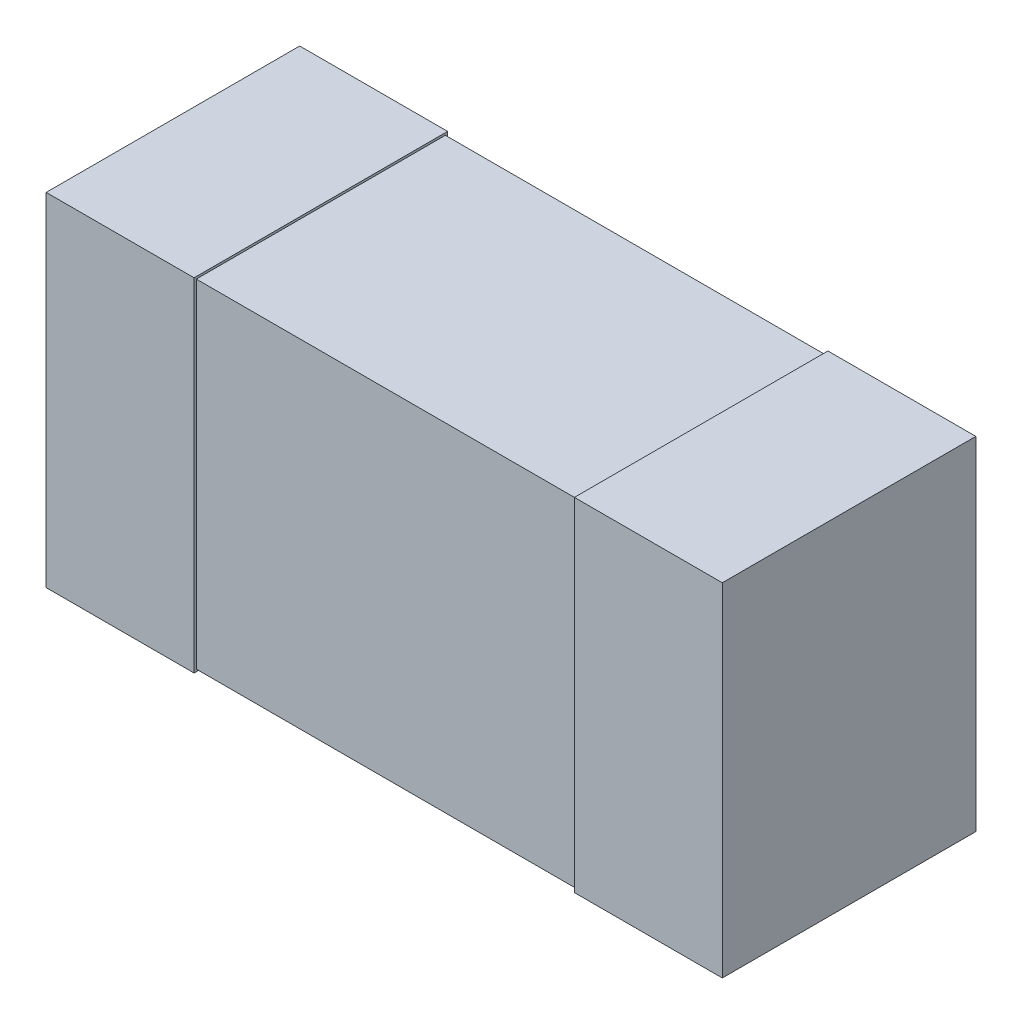
ISO-10303-21;
HEADER;
FILE_DESCRIPTION(('STEP AP214'),'2;1');
FILE_NAME('part.step','',(''),(''),'','','');
FILE_SCHEMA(('AUTOMOTIVE_DESIGN { 1 0 10303 214 1 1 1 1 }'));
ENDSEC;
DATA;
#1=APPLICATION_CONTEXT('core data for automotive mechanical design processes');
#2=APPLICATION_PROTOCOL_DEFINITION('international standard','automotive_design',2000,#1);
#3=PRODUCT_CONTEXT('',#1,'mechanical');
#4=PRODUCT('Part','Part','',(#3));
#5=PRODUCT_RELATED_PRODUCT_CATEGORY('part','',(#4));
#6=PRODUCT_DEFINITION_FORMATION('','',#4);
#7=PRODUCT_DEFINITION_CONTEXT('part definition',#1,'design');
#8=PRODUCT_DEFINITION('design','',#6,#7);
#9=PRODUCT_DEFINITION_SHAPE('','',#8);
#10=(LENGTH_UNIT() NAMED_UNIT(*) SI_UNIT(.MILLI.,.METRE.));
#11=(NAMED_UNIT(*) PLANE_ANGLE_UNIT() SI_UNIT($,.RADIAN.));
#12=(NAMED_UNIT(*) SI_UNIT($,.STERADIAN.) SOLID_ANGLE_UNIT());
#13=UNCERTAINTY_MEASURE_WITH_UNIT(LENGTH_MEASURE(1.E-05),#10,'distance_accuracy_value','');
#14=(GEOMETRIC_REPRESENTATION_CONTEXT(3) GLOBAL_UNCERTAINTY_ASSIGNED_CONTEXT((#13)) GLOBAL_UNIT_ASSIGNED_CONTEXT((#10,
#11,#12)) REPRESENTATION_CONTEXT('',''));
#15=CARTESIAN_POINT('',(0.,0.,0.));
#16=DIRECTION('',(0.,0.,1.));
#17=DIRECTION('',(1.,0.,0.));
#18=AXIS2_PLACEMENT_3D('',#15,#16,#17);
#19=CARTESIAN_POINT('',(0.8,-0.405,0.0762));
#20=DIRECTION('',(1.,0.,0.));
#21=DIRECTION('',(0.,1.,0.));
#22=AXIS2_PLACEMENT_3D('',#19,#20,#21);
#23=PLANE('',#22);
#24=DIRECTION('',(0.,0.,1.));
#25=VECTOR('',#24,1.);
#26=CARTESIAN_POINT('',(0.8,0.405,0.0762));
#27=LINE('',#26,#25);
#28=CARTESIAN_POINT('',(0.8,0.405,0.0762));
#29=VERTEX_POINT('',#28);
#30=CARTESIAN_POINT('',(0.8,0.405,0.6762));
#31=VERTEX_POINT('',#30);
#32=EDGE_CURVE('E150',#29,#31,#27,.T.);
#33=ORIENTED_EDGE('',*,*,#32,.T.);
#34=DIRECTION('',(0.,1.,0.));
#35=VECTOR('',#34,1.);
#36=CARTESIAN_POINT('',(0.8,-0.405,0.6762));
#37=LINE('',#36,#35);
#38=CARTESIAN_POINT('',(0.8,-0.405,0.6762));
#39=VERTEX_POINT('',#38);
#40=EDGE_CURVE('E138',#39,#31,#37,.T.);
#41=ORIENTED_EDGE('',*,*,#40,.F.);
#42=DIRECTION('',(0.,0.,1.));
#43=VECTOR('',#42,1.);
#44=CARTESIAN_POINT('',(0.8,-0.405,0.0762));
#45=LINE('',#44,#43);
#46=CARTESIAN_POINT('',(0.8,-0.405,0.0762));
#47=VERTEX_POINT('',#46);
#48=EDGE_CURVE('E11',#47,#39,#45,.T.);
#49=ORIENTED_EDGE('',*,*,#48,.F.);
#50=DIRECTION('',(0.,1.,0.));
#51=VECTOR('',#50,1.);
#52=CARTESIAN_POINT('',(0.8,-0.405,0.0762));
#53=LINE('',#52,#51);
#54=EDGE_CURVE('E152',#47,#29,#53,.T.);
#55=ORIENTED_EDGE('',*,*,#54,.T.);
#56=EDGE_LOOP('',(#33,#41,#49,#55));
#57=FACE_BOUND('',#56,.T.);
#58=ADVANCED_FACE('F18',(#57),#23,.T.);
#59=CARTESIAN_POINT('',(-0.8,0.405,0.0762));
#60=DIRECTION('',(-1.,0.,0.));
#61=DIRECTION('',(0.,0.,1.));
#62=AXIS2_PLACEMENT_3D('',#59,#60,#61);
#63=PLANE('',#62);
#64=DIRECTION('',(0.,0.,1.));
#65=VECTOR('',#64,1.);
#66=CARTESIAN_POINT('',(-0.8,-0.405,0.0762));
#67=LINE('',#66,#65);
#68=CARTESIAN_POINT('',(-0.8,-0.405,0.0762));
#69=VERTEX_POINT('',#68);
#70=CARTESIAN_POINT('',(-0.8,-0.405,0.6762));
#71=VERTEX_POINT('',#70);
#72=EDGE_CURVE('E28',#69,#71,#67,.T.);
#73=ORIENTED_EDGE('',*,*,#72,.T.);
#74=DIRECTION('',(0.,-1.,0.));
#75=VECTOR('',#74,1.);
#76=CARTESIAN_POINT('',(-0.8,0.405,0.6762));
#77=LINE('',#76,#75);
#78=CARTESIAN_POINT('',(-0.8,0.405,0.6762));
#79=VERTEX_POINT('',#78);
#80=EDGE_CURVE('E157',#79,#71,#77,.T.);
#81=ORIENTED_EDGE('',*,*,#80,.F.);
#82=DIRECTION('',(0.,0.,1.));
#83=VECTOR('',#82,1.);
#84=CARTESIAN_POINT('',(-0.8,0.405,0.0762));
#85=LINE('',#84,#83);
#86=CARTESIAN_POINT('',(-0.8,0.405,0.0762));
#87=VERTEX_POINT('',#86);
#88=EDGE_CURVE('E173',#87,#79,#85,.T.);
#89=ORIENTED_EDGE('',*,*,#88,.F.);
#90=DIRECTION('',(0.,-1.,0.));
#91=VECTOR('',#90,1.);
#92=CARTESIAN_POINT('',(-0.8,0.405,0.0762));
#93=LINE('',#92,#91);
#94=EDGE_CURVE('E21',#87,#69,#93,.T.);
#95=ORIENTED_EDGE('',*,*,#94,.T.);
#96=EDGE_LOOP('',(#73,#81,#89,#95));
#97=FACE_BOUND('',#96,.T.);
#98=ADVANCED_FACE('F536',(#97),#63,.T.);
#99=CARTESIAN_POINT('',(-0.8,-0.405,0.0762));
#100=DIRECTION('',(0.,-1.,0.));
#101=DIRECTION('',(0.,0.,-1.));
#102=AXIS2_PLACEMENT_3D('',#99,#100,#101);
#103=PLANE('',#102);
#104=DIRECTION('',(1.,0.,0.));
#105=VECTOR('',#104,1.);
#106=CARTESIAN_POINT('',(0.45,-0.405,0.0762));
#107=LINE('',#106,#105);
#108=CARTESIAN_POINT('',(0.45,-0.405,0.0762));
#109=VERTEX_POINT('',#108);
#110=EDGE_CURVE('E224',#109,#47,#107,.T.);
#111=ORIENTED_EDGE('',*,*,#110,.T.);
#112=ORIENTED_EDGE('',*,*,#48,.T.);
#113=DIRECTION('',(1.,0.,0.));
#114=VECTOR('',#113,1.);
#115=CARTESIAN_POINT('',(0.45,-0.405,0.6762));
#116=LINE('',#115,#114);
#117=CARTESIAN_POINT('',(0.45,-0.405,0.6762));
#118=VERTEX_POINT('',#117);
#119=EDGE_CURVE('E145',#118,#39,#116,.T.);
#120=ORIENTED_EDGE('',*,*,#119,.F.);
#121=DIRECTION('',(0.,0.,1.));
#122=VECTOR('',#121,1.);
#123=CARTESIAN_POINT('',(0.45,-0.405,0.0762));
#124=LINE('',#123,#122);
#125=EDGE_CURVE('E199',#109,#118,#124,.T.);
#126=ORIENTED_EDGE('',*,*,#125,.F.);
#127=EDGE_LOOP('',(#111,#112,#120,#126));
#128=FACE_BOUND('',#127,.T.);
#129=ADVANCED_FACE('F281',(#128),#103,.T.);
#130=CARTESIAN_POINT('',(-0.8,-0.405,0.0762));
#131=DIRECTION('',(0.,-1.,0.));
#132=DIRECTION('',(0.,0.,-1.));
#133=AXIS2_PLACEMENT_3D('',#130,#131,#132);
#134=PLANE('',#133);
#135=DIRECTION('',(1.,0.,0.));
#136=VECTOR('',#135,1.);
#137=CARTESIAN_POINT('',(-0.8,-0.405,0.6762));
#138=LINE('',#137,#136);
#139=CARTESIAN_POINT('',(-0.45,-0.405,0.6762));
#140=VERTEX_POINT('',#139);
#141=EDGE_CURVE('E238',#71,#140,#138,.T.);
#142=ORIENTED_EDGE('',*,*,#141,.F.);
#143=ORIENTED_EDGE('',*,*,#72,.F.);
#144=DIRECTION('',(1.,0.,0.));
#145=VECTOR('',#144,1.);
#146=CARTESIAN_POINT('',(-0.8,-0.405,0.0762));
#147=LINE('',#146,#145);
#148=CARTESIAN_POINT('',(-0.45,-0.405,0.0762));
#149=VERTEX_POINT('',#148);
#150=EDGE_CURVE('E226',#69,#149,#147,.T.);
#151=ORIENTED_EDGE('',*,*,#150,.T.);
#152=DIRECTION('',(0.,0.,1.));
#153=VECTOR('',#152,1.);
#154=CARTESIAN_POINT('',(-0.45,-0.405,0.0762));
#155=LINE('',#154,#153);
#156=EDGE_CURVE('E83',#149,#140,#155,.T.);
#157=ORIENTED_EDGE('',*,*,#156,.T.);
#158=EDGE_LOOP('',(#142,#143,#151,#157));
#159=FACE_BOUND('',#158,.T.);
#160=ADVANCED_FACE('F508',(#159),#134,.T.);
#161=CARTESIAN_POINT('',(0.,0.,0.6762));
#162=DIRECTION('',(0.,0.,1.));
#163=DIRECTION('',(1.,0.,0.));
#164=AXIS2_PLACEMENT_3D('',#161,#162,#163);
#165=PLANE('',#164);
#166=ORIENTED_EDGE('',*,*,#119,.T.);
#167=ORIENTED_EDGE('',*,*,#40,.T.);
#168=DIRECTION('',(-1.,0.,0.));
#169=VECTOR('',#168,1.);
#170=CARTESIAN_POINT('',(0.8,0.405,0.6762));
#171=LINE('',#170,#169);
#172=CARTESIAN_POINT('',(0.45,0.405,0.6762));
#173=VERTEX_POINT('',#172);
#174=EDGE_CURVE('E143',#31,#173,#171,.T.);
#175=ORIENTED_EDGE('',*,*,#174,.T.);
#176=DIRECTION('',(0.,1.,0.));
#177=VECTOR('',#176,1.);
#178=CARTESIAN_POINT('',(0.45,-0.405,0.6762));
#179=LINE('',#178,#177);
#180=EDGE_CURVE('E179',#118,#173,#179,.T.);
#181=ORIENTED_EDGE('',*,*,#180,.F.);
#182=EDGE_LOOP('',(#166,#167,#175,#181));
#183=FACE_BOUND('',#182,.T.);
#184=ADVANCED_FACE('F140',(#183),#165,.T.);
#185=CARTESIAN_POINT('',(0.,0.,0.6762));
#186=DIRECTION('',(0.,0.,1.));
#187=DIRECTION('',(1.,0.,0.));
#188=AXIS2_PLACEMENT_3D('',#185,#186,#187);
#189=PLANE('',#188);
#190=DIRECTION('',(-1.,0.,0.));
#191=VECTOR('',#190,1.);
#192=CARTESIAN_POINT('',(-0.45,0.405,0.6762));
#193=LINE('',#192,#191);
#194=CARTESIAN_POINT('',(-0.45,0.405,0.6762));
#195=VERTEX_POINT('',#194);
#196=EDGE_CURVE('E164',#195,#79,#193,.T.);
#197=ORIENTED_EDGE('',*,*,#196,.T.);
#198=ORIENTED_EDGE('',*,*,#80,.T.);
#199=ORIENTED_EDGE('',*,*,#141,.T.);
#200=DIRECTION('',(0.,1.,0.));
#201=VECTOR('',#200,1.);
#202=CARTESIAN_POINT('',(-0.45,-0.405,0.6762));
#203=LINE('',#202,#201);
#204=EDGE_CURVE('E184',#140,#195,#203,.T.);
#205=ORIENTED_EDGE('',*,*,#204,.T.);
#206=EDGE_LOOP('',(#197,#198,#199,#205));
#207=FACE_BOUND('',#206,.T.);
#208=ADVANCED_FACE('F523',(#207),#189,.T.);
#209=CARTESIAN_POINT('',(0.8,0.405,0.0762));
#210=DIRECTION('',(0.,1.,0.));
#211=DIRECTION('',(1.,0.,0.));
#212=AXIS2_PLACEMENT_3D('',#209,#210,#211);
#213=PLANE('',#212);
#214=ORIENTED_EDGE('',*,*,#174,.F.);
#215=ORIENTED_EDGE('',*,*,#32,.F.);
#216=DIRECTION('',(-1.,0.,0.));
#217=VECTOR('',#216,1.);
#218=CARTESIAN_POINT('',(0.8,0.405,0.0762));
#219=LINE('',#218,#217);
#220=CARTESIAN_POINT('',(0.45,0.405,0.0762));
#221=VERTEX_POINT('',#220);
#222=EDGE_CURVE('E225',#29,#221,#219,.T.);
#223=ORIENTED_EDGE('',*,*,#222,.T.);
#224=DIRECTION('',(0.,0.,1.));
#225=VECTOR('',#224,1.);
#226=CARTESIAN_POINT('',(0.45,0.405,0.0762));
#227=LINE('',#226,#225);
#228=EDGE_CURVE('E161',#221,#173,#227,.T.);
#229=ORIENTED_EDGE('',*,*,#228,.T.);
#230=EDGE_LOOP('',(#214,#215,#223,#229));
#231=FACE_BOUND('',#230,.T.);
#232=ADVANCED_FACE('F159',(#231),#213,.T.);
#233=CARTESIAN_POINT('',(0.8,0.405,0.0762));
#234=DIRECTION('',(0.,1.,0.));
#235=DIRECTION('',(1.,0.,0.));
#236=AXIS2_PLACEMENT_3D('',#233,#234,#235);
#237=PLANE('',#236);
#238=DIRECTION('',(-1.,0.,0.));
#239=VECTOR('',#238,1.);
#240=CARTESIAN_POINT('',(-0.45,0.405,0.0762));
#241=LINE('',#240,#239);
#242=CARTESIAN_POINT('',(-0.45,0.405,0.0762));
#243=VERTEX_POINT('',#242);
#244=EDGE_CURVE('E254',#243,#87,#241,.T.);
#245=ORIENTED_EDGE('',*,*,#244,.T.);
#246=ORIENTED_EDGE('',*,*,#88,.T.);
#247=ORIENTED_EDGE('',*,*,#196,.F.);
#248=DIRECTION('',(0.,0.,1.));
#249=VECTOR('',#248,1.);
#250=CARTESIAN_POINT('',(-0.45,0.405,0.0762));
#251=LINE('',#250,#249);
#252=EDGE_CURVE('E209',#243,#195,#251,.T.);
#253=ORIENTED_EDGE('',*,*,#252,.F.);
#254=EDGE_LOOP('',(#245,#246,#247,#253));
#255=FACE_BOUND('',#254,.T.);
#256=ADVANCED_FACE('F585',(#255),#237,.T.);
#257=CARTESIAN_POINT('',(0.45,-0.405,0.081534));
#258=DIRECTION('',(1.,0.,0.));
#259=DIRECTION('',(0.,1.,0.));
#260=AXIS2_PLACEMENT_3D('',#257,#258,#259);
#261=PLANE('',#260);
#262=DIRECTION('',(0.,0.,1.));
#263=VECTOR('',#262,1.);
#264=CARTESIAN_POINT('',(0.45,0.399666,0.081534));
#265=LINE('',#264,#263);
#266=CARTESIAN_POINT('',(0.45,0.399666,0.081534));
#267=VERTEX_POINT('',#266);
#268=CARTESIAN_POINT('',(0.45,0.399666,0.670866));
#269=VERTEX_POINT('',#268);
#270=EDGE_CURVE('E218',#267,#269,#265,.T.);
#271=ORIENTED_EDGE('',*,*,#270,.T.);
#272=DIRECTION('',(0.,-1.,0.));
#273=VECTOR('',#272,1.);
#274=CARTESIAN_POINT('',(0.45,0.399666,0.670866));
#275=LINE('',#274,#273);
#276=CARTESIAN_POINT('',(0.45,-0.399666,0.670866));
#277=VERTEX_POINT('',#276);
#278=EDGE_CURVE('E194',#269,#277,#275,.T.);
#279=ORIENTED_EDGE('',*,*,#278,.T.);
#280=DIRECTION('',(0.,0.,-1.));
#281=VECTOR('',#280,1.);
#282=CARTESIAN_POINT('',(0.45,-0.399666,0.670866));
#283=LINE('',#282,#281);
#284=CARTESIAN_POINT('',(0.45,-0.399666,0.081534));
#285=VERTEX_POINT('',#284);
#286=EDGE_CURVE('E195',#277,#285,#283,.T.);
#287=ORIENTED_EDGE('',*,*,#286,.T.);
#288=DIRECTION('',(0.,1.,0.));
#289=VECTOR('',#288,1.);
#290=CARTESIAN_POINT('',(0.45,-0.399666,0.081534));
#291=LINE('',#290,#289);
#292=EDGE_CURVE('E196',#285,#267,#291,.T.);
#293=ORIENTED_EDGE('',*,*,#292,.T.);
#294=EDGE_LOOP('',(#271,#279,#287,#293));
#295=FACE_BOUND('',#294,.T.);
#296=ORIENTED_EDGE('',*,*,#125,.T.);
#297=ORIENTED_EDGE('',*,*,#180,.T.);
#298=ORIENTED_EDGE('',*,*,#228,.F.);
#299=DIRECTION('',(0.,1.,0.));
#300=VECTOR('',#299,1.);
#301=CARTESIAN_POINT('',(0.45,-0.405,0.0762));
#302=LINE('',#301,#300);
#303=EDGE_CURVE('E213',#109,#221,#302,.T.);
#304=ORIENTED_EDGE('',*,*,#303,.F.);
#305=EDGE_LOOP('',(#296,#297,#298,#304));
#306=FACE_BOUND('',#305,.T.);
#307=ADVANCED_FACE('F289',(#295,#306),#261,.F.);
#308=CARTESIAN_POINT('',(-0.45,-0.405,0.081534));
#309=DIRECTION('',(0.,0.,1.));
#310=DIRECTION('',(1.,0.,0.));
#311=AXIS2_PLACEMENT_3D('',#308,#309,#310);
#312=PLANE('',#311);
#313=DIRECTION('',(0.,1.,0.));
#314=VECTOR('',#313,1.);
#315=CARTESIAN_POINT('',(-0.45,-0.399666,0.081534));
#316=LINE('',#315,#314);
#317=CARTESIAN_POINT('',(-0.45,-0.399666,0.081534));
#318=VERTEX_POINT('',#317);
#319=CARTESIAN_POINT('',(-0.45,0.399666,0.081534));
#320=VERTEX_POINT('',#319);
#321=EDGE_CURVE('E177',#318,#320,#316,.T.);
#322=ORIENTED_EDGE('',*,*,#321,.T.);
#323=DIRECTION('',(1.,0.,0.));
#324=VECTOR('',#323,1.);
#325=CARTESIAN_POINT('',(-0.45,0.399666,0.081534));
#326=LINE('',#325,#324);
#327=EDGE_CURVE('E200',#320,#267,#326,.T.);
#328=ORIENTED_EDGE('',*,*,#327,.T.);
#329=ORIENTED_EDGE('',*,*,#292,.F.);
#330=DIRECTION('',(1.,0.,0.));
#331=VECTOR('',#330,1.);
#332=CARTESIAN_POINT('',(-0.45,-0.399666,0.081534));
#333=LINE('',#332,#331);
#334=EDGE_CURVE('E188',#318,#285,#333,.T.);
#335=ORIENTED_EDGE('',*,*,#334,.F.);
#336=EDGE_LOOP('',(#322,#328,#329,#335));
#337=FACE_BOUND('',#336,.T.);
#338=ADVANCED_FACE('F584',(#337),#312,.F.);
#339=CARTESIAN_POINT('',(-0.45,0.399666,0.0762));
#340=DIRECTION('',(0.,-1.,0.));
#341=DIRECTION('',(0.,0.,-1.));
#342=AXIS2_PLACEMENT_3D('',#339,#340,#341);
#343=PLANE('',#342);
#344=DIRECTION('',(0.,0.,1.));
#345=VECTOR('',#344,1.);
#346=CARTESIAN_POINT('',(-0.45,0.399666,0.081534));
#347=LINE('',#346,#345);
#348=CARTESIAN_POINT('',(-0.45,0.399666,0.670866));
#349=VERTEX_POINT('',#348);
#350=EDGE_CURVE('E257',#320,#349,#347,.T.);
#351=ORIENTED_EDGE('',*,*,#350,.T.);
#352=DIRECTION('',(1.,0.,0.));
#353=VECTOR('',#352,1.);
#354=CARTESIAN_POINT('',(-0.45,0.399666,0.670866));
#355=LINE('',#354,#353);
#356=EDGE_CURVE('E214',#349,#269,#355,.T.);
#357=ORIENTED_EDGE('',*,*,#356,.T.);
#358=ORIENTED_EDGE('',*,*,#270,.F.);
#359=ORIENTED_EDGE('',*,*,#327,.F.);
#360=EDGE_LOOP('',(#351,#357,#358,#359));
#361=FACE_BOUND('',#360,.T.);
#362=ADVANCED_FACE('F621',(#361),#343,.F.);
#363=CARTESIAN_POINT('',(-0.45,0.405,0.670866));
#364=DIRECTION('',(0.,0.,-1.));
#365=DIRECTION('',(0.,-1.,0.));
#366=AXIS2_PLACEMENT_3D('',#363,#364,#365);
#367=PLANE('',#366);
#368=DIRECTION('',(0.,-1.,0.));
#369=VECTOR('',#368,1.);
#370=CARTESIAN_POINT('',(-0.45,0.399666,0.670866));
#371=LINE('',#370,#369);
#372=CARTESIAN_POINT('',(-0.45,-0.399666,0.670866));
#373=VERTEX_POINT('',#372);
#374=EDGE_CURVE('E183',#349,#373,#371,.T.);
#375=ORIENTED_EDGE('',*,*,#374,.T.);
#376=DIRECTION('',(1.,0.,0.));
#377=VECTOR('',#376,1.);
#378=CARTESIAN_POINT('',(-0.45,-0.399666,0.670866));
#379=LINE('',#378,#377);
#380=EDGE_CURVE('E190',#373,#277,#379,.T.);
#381=ORIENTED_EDGE('',*,*,#380,.T.);
#382=ORIENTED_EDGE('',*,*,#278,.F.);
#383=ORIENTED_EDGE('',*,*,#356,.F.);
#384=EDGE_LOOP('',(#375,#381,#382,#383));
#385=FACE_BOUND('',#384,.T.);
#386=ADVANCED_FACE('F610',(#385),#367,.F.);
#387=CARTESIAN_POINT('',(-0.45,-0.399666,0.6762));
#388=DIRECTION('',(0.,1.,0.));
#389=DIRECTION('',(1.,0.,0.));
#390=AXIS2_PLACEMENT_3D('',#387,#388,#389);
#391=PLANE('',#390);
#392=DIRECTION('',(0.,0.,-1.));
#393=VECTOR('',#392,1.);
#394=CARTESIAN_POINT('',(-0.45,-0.399666,0.670866));
#395=LINE('',#394,#393);
#396=EDGE_CURVE('E185',#373,#318,#395,.T.);
#397=ORIENTED_EDGE('',*,*,#396,.T.);
#398=ORIENTED_EDGE('',*,*,#334,.T.);
#399=ORIENTED_EDGE('',*,*,#286,.F.);
#400=ORIENTED_EDGE('',*,*,#380,.F.);
#401=EDGE_LOOP('',(#397,#398,#399,#400));
#402=FACE_BOUND('',#401,.T.);
#403=ADVANCED_FACE('F598',(#402),#391,.F.);
#404=CARTESIAN_POINT('',(-0.45,-0.405,0.0762));
#405=DIRECTION('',(-1.,0.,0.));
#406=DIRECTION('',(0.,0.,1.));
#407=AXIS2_PLACEMENT_3D('',#404,#405,#406);
#408=PLANE('',#407);
#409=ORIENTED_EDGE('',*,*,#374,.F.);
#410=ORIENTED_EDGE('',*,*,#350,.F.);
#411=ORIENTED_EDGE('',*,*,#321,.F.);
#412=ORIENTED_EDGE('',*,*,#396,.F.);
#413=EDGE_LOOP('',(#409,#410,#411,#412));
#414=FACE_BOUND('',#413,.T.);
#415=ORIENTED_EDGE('',*,*,#252,.T.);
#416=ORIENTED_EDGE('',*,*,#204,.F.);
#417=ORIENTED_EDGE('',*,*,#156,.F.);
#418=DIRECTION('',(0.,1.,0.));
#419=VECTOR('',#418,1.);
#420=CARTESIAN_POINT('',(-0.45,-0.405,0.0762));
#421=LINE('',#420,#419);
#422=EDGE_CURVE('E234',#149,#243,#421,.T.);
#423=ORIENTED_EDGE('',*,*,#422,.T.);
#424=EDGE_LOOP('',(#415,#416,#417,#423));
#425=FACE_BOUND('',#424,.T.);
#426=ADVANCED_FACE('F565',(#414,#425),#408,.F.);
#427=CARTESIAN_POINT('',(0.,0.,0.0762));
#428=DIRECTION('',(0.,0.,1.));
#429=DIRECTION('',(1.,0.,0.));
#430=AXIS2_PLACEMENT_3D('',#427,#428,#429);
#431=PLANE('',#430);
#432=ORIENTED_EDGE('',*,*,#222,.F.);
#433=ORIENTED_EDGE('',*,*,#54,.F.);
#434=ORIENTED_EDGE('',*,*,#110,.F.);
#435=ORIENTED_EDGE('',*,*,#303,.T.);
#436=EDGE_LOOP('',(#432,#433,#434,#435));
#437=FACE_BOUND('',#436,.T.);
#438=ADVANCED_FACE('F285',(#437),#431,.F.);
#439=CARTESIAN_POINT('',(0.,0.,0.0762));
#440=DIRECTION('',(0.,0.,1.));
#441=DIRECTION('',(1.,0.,0.));
#442=AXIS2_PLACEMENT_3D('',#439,#440,#441);
#443=PLANE('',#442);
#444=ORIENTED_EDGE('',*,*,#150,.F.);
#445=ORIENTED_EDGE('',*,*,#94,.F.);
#446=ORIENTED_EDGE('',*,*,#244,.F.);
#447=ORIENTED_EDGE('',*,*,#422,.F.);
#448=EDGE_LOOP('',(#444,#445,#446,#447));
#449=FACE_BOUND('',#448,.T.);
#450=ADVANCED_FACE('F549',(#449),#443,.F.);
#451=CLOSED_SHELL('',(#58,#98,#129,#160,#184,#208,#232,#256,#307,#338,#362,#386,#403,#426,#438,#450));
#452=MANIFOLD_SOLID_BREP('B1',#451);
#453=ADVANCED_BREP_SHAPE_REPRESENTATION('',(#18,#452),#14);
#454=SHAPE_DEFINITION_REPRESENTATION(#9,#453);
ENDSEC;
END-ISO-10303-21;
